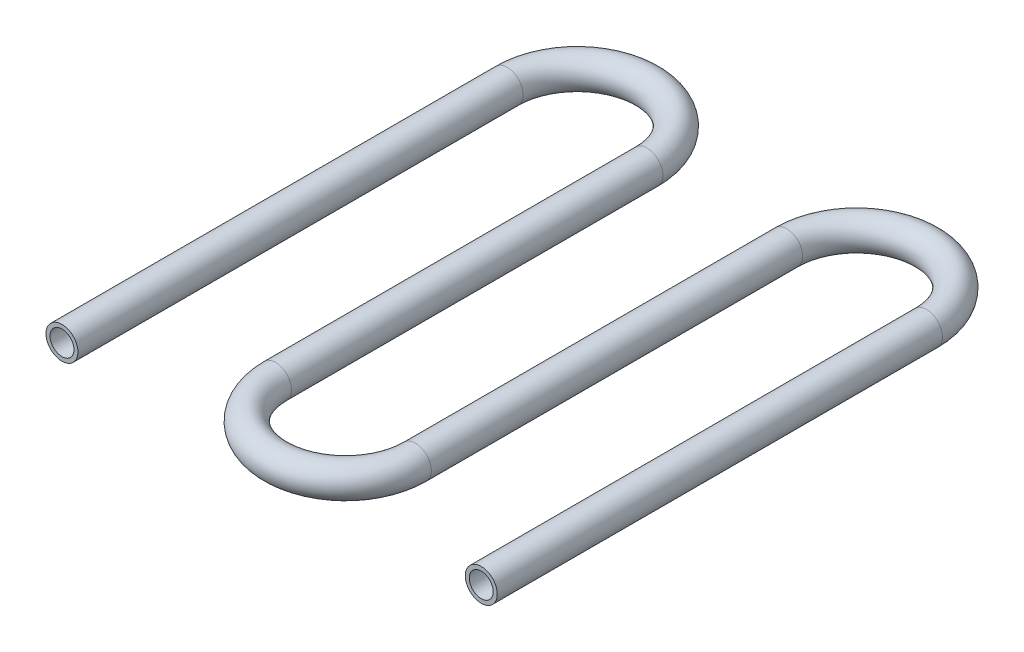
ISO-10303-21;
HEADER;
FILE_DESCRIPTION(('STEP AP214'),'2;1');
FILE_NAME('part.step','',(''),(''),'','','');
FILE_SCHEMA(('AUTOMOTIVE_DESIGN { 1 0 10303 214 1 1 1 1 }'));
ENDSEC;
DATA;
#1=APPLICATION_CONTEXT('core data for automotive mechanical design processes');
#2=APPLICATION_PROTOCOL_DEFINITION('international standard','automotive_design',2000,#1);
#3=PRODUCT_CONTEXT('',#1,'mechanical');
#4=PRODUCT('Part','Part','',(#3));
#5=PRODUCT_RELATED_PRODUCT_CATEGORY('part','',(#4));
#6=PRODUCT_DEFINITION_FORMATION('','',#4);
#7=PRODUCT_DEFINITION_CONTEXT('part definition',#1,'design');
#8=PRODUCT_DEFINITION('design','',#6,#7);
#9=PRODUCT_DEFINITION_SHAPE('','',#8);
#10=(LENGTH_UNIT() NAMED_UNIT(*) SI_UNIT(.MILLI.,.METRE.));
#11=(NAMED_UNIT(*) PLANE_ANGLE_UNIT() SI_UNIT($,.RADIAN.));
#12=(NAMED_UNIT(*) SI_UNIT($,.STERADIAN.) SOLID_ANGLE_UNIT());
#13=UNCERTAINTY_MEASURE_WITH_UNIT(LENGTH_MEASURE(1.E-05),#10,'distance_accuracy_value','');
#14=(GEOMETRIC_REPRESENTATION_CONTEXT(3) GLOBAL_UNCERTAINTY_ASSIGNED_CONTEXT((#13)) GLOBAL_UNIT_ASSIGNED_CONTEXT((#10,
#11,#12)) REPRESENTATION_CONTEXT('',''));
#15=CARTESIAN_POINT('',(0.,0.,0.));
#16=DIRECTION('',(0.,0.,1.));
#17=DIRECTION('',(1.,0.,0.));
#18=AXIS2_PLACEMENT_3D('',#15,#16,#17);
#19=CARTESIAN_POINT('',(-17.5,0.,65.));
#20=DIRECTION('',(0.,0.,-1.));
#21=DIRECTION('',(-1.,0.,0.));
#22=AXIS2_PLACEMENT_3D('',#19,#20,#21);
#23=CYLINDRICAL_SURFACE('',#22,4.);
#24=CARTESIAN_POINT('',(-17.5,0.,-46.5));
#25=DIRECTION('',(0.,0.,1.));
#26=DIRECTION('',(1.,0.,0.));
#27=AXIS2_PLACEMENT_3D('',#24,#25,#26);
#28=CIRCLE('',#27,4.);
#29=CARTESIAN_POINT('',(-21.5,0.,-46.5));
#30=VERTEX_POINT('',#29);
#31=EDGE_CURVE('E65',#30,#30,#28,.T.);
#32=ORIENTED_EDGE('',*,*,#31,.T.);
#33=EDGE_LOOP('',(#32));
#34=FACE_BOUND('',#33,.T.);
#35=CARTESIAN_POINT('',(-17.5,0.,65.));
#36=DIRECTION('',(0.,0.,1.));
#37=DIRECTION('',(1.,0.,0.));
#38=AXIS2_PLACEMENT_3D('',#35,#36,#37);
#39=CIRCLE('',#38,4.);
#40=CARTESIAN_POINT('',(-13.5,0.,65.));
#41=VERTEX_POINT('',#40);
#42=EDGE_CURVE('E61',#41,#41,#39,.T.);
#43=ORIENTED_EDGE('',*,*,#42,.F.);
#44=EDGE_LOOP('',(#43));
#45=FACE_BOUND('',#44,.T.);
#46=ADVANCED_FACE('F37',(#34,#45),#23,.T.);
#47=CARTESIAN_POINT('',(0.,0.,-46.5));
#48=DIRECTION('',(0.,-1.,0.));
#49=DIRECTION('',(0.,0.,-1.));
#50=AXIS2_PLACEMENT_3D('',#47,#48,#49);
#51=TOROIDAL_SURFACE('',#50,17.5,4.);
#52=CARTESIAN_POINT('',(17.5,0.,-46.5));
#53=DIRECTION('',(0.,0.,-1.));
#54=DIRECTION('',(-1.,0.,0.));
#55=AXIS2_PLACEMENT_3D('',#52,#53,#54);
#56=CIRCLE('',#55,4.);
#57=CARTESIAN_POINT('',(21.5,0.,-46.5));
#58=VERTEX_POINT('',#57);
#59=EDGE_CURVE('E69',#58,#58,#56,.T.);
#60=CARTESIAN_POINT('',(0.,0.,-46.5));
#61=DIRECTION('',(0.,-1.,0.));
#62=DIRECTION('',(0.,0.,-1.));
#63=AXIS2_PLACEMENT_3D('',#60,#61,#62);
#64=CIRCLE('',#63,21.5);
#65=EDGE_CURVE('',#30,#58,#64,.T.);
#66=ORIENTED_EDGE('',*,*,#31,.F.);
#67=ORIENTED_EDGE('',*,*,#59,.T.);
#68=ORIENTED_EDGE('',*,*,#65,.T.);
#69=ORIENTED_EDGE('',*,*,#65,.F.);
#70=EDGE_LOOP('',(#66,#68,#67,#69));
#71=FACE_BOUND('',#70,.T.);
#72=ADVANCED_FACE('F122',(#71),#51,.T.);
#73=CARTESIAN_POINT('',(17.5,0.,-46.5));
#74=DIRECTION('',(0.,0.,1.));
#75=DIRECTION('',(1.,0.,0.));
#76=AXIS2_PLACEMENT_3D('',#73,#74,#75);
#77=CYLINDRICAL_SURFACE('',#76,4.);
#78=CARTESIAN_POINT('',(17.5,0.,46.5));
#79=DIRECTION('',(0.,0.,-1.));
#80=DIRECTION('',(-1.,0.,0.));
#81=AXIS2_PLACEMENT_3D('',#78,#79,#80);
#82=CIRCLE('',#81,4.);
#83=CARTESIAN_POINT('',(13.5,0.,46.5));
#84=VERTEX_POINT('',#83);
#85=EDGE_CURVE('E73',#84,#84,#82,.T.);
#86=ORIENTED_EDGE('',*,*,#85,.T.);
#87=EDGE_LOOP('',(#86));
#88=FACE_BOUND('',#87,.T.);
#89=ORIENTED_EDGE('',*,*,#59,.F.);
#90=EDGE_LOOP('',(#89));
#91=FACE_BOUND('',#90,.T.);
#92=ADVANCED_FACE('F126',(#88,#91),#77,.T.);
#93=CARTESIAN_POINT('',(35.,0.,46.5));
#94=DIRECTION('',(0.,1.,0.));
#95=DIRECTION('',(0.,0.,1.));
#96=AXIS2_PLACEMENT_3D('',#93,#94,#95);
#97=TOROIDAL_SURFACE('',#96,17.5,4.);
#98=CARTESIAN_POINT('',(52.5,0.,46.5));
#99=DIRECTION('',(0.,0.,1.));
#100=DIRECTION('',(1.,0.,0.));
#101=AXIS2_PLACEMENT_3D('',#98,#99,#100);
#102=CIRCLE('',#101,4.);
#103=CARTESIAN_POINT('',(56.5,0.,46.5));
#104=VERTEX_POINT('',#103);
#105=EDGE_CURVE('E77',#104,#104,#102,.T.);
#106=CARTESIAN_POINT('',(35.,0.,46.5));
#107=DIRECTION('',(0.,1.,0.));
#108=DIRECTION('',(0.,0.,1.));
#109=AXIS2_PLACEMENT_3D('',#106,#107,#108);
#110=CIRCLE('',#109,21.5);
#111=EDGE_CURVE('',#84,#104,#110,.T.);
#112=ORIENTED_EDGE('',*,*,#85,.F.);
#113=ORIENTED_EDGE('',*,*,#105,.T.);
#114=ORIENTED_EDGE('',*,*,#111,.T.);
#115=ORIENTED_EDGE('',*,*,#111,.F.);
#116=EDGE_LOOP('',(#112,#114,#113,#115));
#117=FACE_BOUND('',#116,.T.);
#118=ADVANCED_FACE('F130',(#117),#97,.T.);
#119=CARTESIAN_POINT('',(52.5,0.,46.5));
#120=DIRECTION('',(0.,0.,-1.));
#121=DIRECTION('',(-1.,0.,0.));
#122=AXIS2_PLACEMENT_3D('',#119,#120,#121);
#123=CYLINDRICAL_SURFACE('',#122,4.);
#124=CARTESIAN_POINT('',(52.5,0.,-46.5));
#125=DIRECTION('',(0.,0.,1.));
#126=DIRECTION('',(1.,0.,0.));
#127=AXIS2_PLACEMENT_3D('',#124,#125,#126);
#128=CIRCLE('',#127,4.);
#129=CARTESIAN_POINT('',(48.5,0.,-46.5));
#130=VERTEX_POINT('',#129);
#131=EDGE_CURVE('E80',#130,#130,#128,.T.);
#132=ORIENTED_EDGE('',*,*,#131,.T.);
#133=EDGE_LOOP('',(#132));
#134=FACE_BOUND('',#133,.T.);
#135=ORIENTED_EDGE('',*,*,#105,.F.);
#136=EDGE_LOOP('',(#135));
#137=FACE_BOUND('',#136,.T.);
#138=ADVANCED_FACE('F102',(#134,#137),#123,.T.);
#139=CARTESIAN_POINT('',(70.,0.,-46.5));
#140=DIRECTION('',(0.,-1.,0.));
#141=DIRECTION('',(0.,0.,-1.));
#142=AXIS2_PLACEMENT_3D('',#139,#140,#141);
#143=TOROIDAL_SURFACE('',#142,17.5,4.);
#144=CARTESIAN_POINT('',(87.5,0.,-46.5));
#145=DIRECTION('',(0.,0.,-1.));
#146=DIRECTION('',(-1.,0.,0.));
#147=AXIS2_PLACEMENT_3D('',#144,#145,#146);
#148=CIRCLE('',#147,4.);
#149=CARTESIAN_POINT('',(91.5,0.,-46.5));
#150=VERTEX_POINT('',#149);
#151=EDGE_CURVE('E41',#150,#150,#148,.T.);
#152=CARTESIAN_POINT('',(70.,0.,-46.5));
#153=DIRECTION('',(0.,-1.,0.));
#154=DIRECTION('',(0.,0.,-1.));
#155=AXIS2_PLACEMENT_3D('',#152,#153,#154);
#156=CIRCLE('',#155,21.5);
#157=EDGE_CURVE('',#130,#150,#156,.T.);
#158=ORIENTED_EDGE('',*,*,#131,.F.);
#159=ORIENTED_EDGE('',*,*,#151,.T.);
#160=ORIENTED_EDGE('',*,*,#157,.T.);
#161=ORIENTED_EDGE('',*,*,#157,.F.);
#162=EDGE_LOOP('',(#158,#160,#159,#161));
#163=FACE_BOUND('',#162,.T.);
#164=ADVANCED_FACE('F89',(#163),#143,.T.);
#165=CARTESIAN_POINT('',(87.5,0.,-46.5));
#166=DIRECTION('',(0.,0.,1.));
#167=DIRECTION('',(1.,0.,0.));
#168=AXIS2_PLACEMENT_3D('',#165,#166,#167);
#169=CYLINDRICAL_SURFACE('',#168,4.);
#170=CARTESIAN_POINT('',(87.5,0.,65.));
#171=DIRECTION('',(0.,0.,-1.));
#172=DIRECTION('',(-1.,0.,0.));
#173=AXIS2_PLACEMENT_3D('',#170,#171,#172);
#174=CIRCLE('',#173,4.);
#175=CARTESIAN_POINT('',(83.5,0.,65.));
#176=VERTEX_POINT('',#175);
#177=EDGE_CURVE('E56',#176,#176,#174,.T.);
#178=ORIENTED_EDGE('',*,*,#177,.T.);
#179=EDGE_LOOP('',(#178));
#180=FACE_BOUND('',#179,.T.);
#181=ORIENTED_EDGE('',*,*,#151,.F.);
#182=EDGE_LOOP('',(#181));
#183=FACE_BOUND('',#182,.T.);
#184=ADVANCED_FACE('F39',(#180,#183),#169,.T.);
#185=CARTESIAN_POINT('',(-17.5,0.,65.));
#186=DIRECTION('',(0.,0.,1.));
#187=DIRECTION('',(1.,0.,0.));
#188=AXIS2_PLACEMENT_3D('',#185,#186,#187);
#189=PLANE('',#188);
#190=CARTESIAN_POINT('',(-17.5,0.,65.));
#191=DIRECTION('',(0.,0.,1.));
#192=DIRECTION('',(1.,0.,0.));
#193=AXIS2_PLACEMENT_3D('',#190,#191,#192);
#194=CIRCLE('',#193,3.);
#195=CARTESIAN_POINT('',(-14.5,0.,65.));
#196=VERTEX_POINT('',#195);
#197=EDGE_CURVE('E60',#196,#196,#194,.F.);
#198=ORIENTED_EDGE('',*,*,#197,.T.);
#199=EDGE_LOOP('',(#198));
#200=FACE_BOUND('',#199,.T.);
#201=ORIENTED_EDGE('',*,*,#42,.T.);
#202=EDGE_LOOP('',(#201));
#203=FACE_BOUND('',#202,.T.);
#204=ADVANCED_FACE('F93',(#200,#203),#189,.T.);
#205=CARTESIAN_POINT('',(87.5,0.,65.));
#206=DIRECTION('',(0.,0.,-1.));
#207=DIRECTION('',(-1.,0.,0.));
#208=AXIS2_PLACEMENT_3D('',#205,#206,#207);
#209=PLANE('',#208);
#210=CARTESIAN_POINT('',(87.5,0.,65.));
#211=DIRECTION('',(0.,0.,-1.));
#212=DIRECTION('',(-1.,0.,0.));
#213=AXIS2_PLACEMENT_3D('',#210,#211,#212);
#214=CIRCLE('',#213,3.);
#215=CARTESIAN_POINT('',(84.5,0.,65.));
#216=VERTEX_POINT('',#215);
#217=EDGE_CURVE('E10',#216,#216,#214,.F.);
#218=ORIENTED_EDGE('',*,*,#217,.F.);
#219=EDGE_LOOP('',(#218));
#220=FACE_BOUND('',#219,.T.);
#221=ORIENTED_EDGE('',*,*,#177,.F.);
#222=EDGE_LOOP('',(#221));
#223=FACE_BOUND('',#222,.T.);
#224=ADVANCED_FACE('F99',(#220,#223),#209,.F.);
#225=CARTESIAN_POINT('',(-17.5,0.,65.));
#226=DIRECTION('',(0.,0.,-1.));
#227=DIRECTION('',(-1.,0.,0.));
#228=AXIS2_PLACEMENT_3D('',#225,#226,#227);
#229=CYLINDRICAL_SURFACE('',#228,3.);
#230=CARTESIAN_POINT('',(-17.5,0.,-46.5));
#231=DIRECTION('',(0.,0.,1.));
#232=DIRECTION('',(1.,0.,0.));
#233=AXIS2_PLACEMENT_3D('',#230,#231,#232);
#234=CIRCLE('',#233,3.);
#235=CARTESIAN_POINT('',(-20.5,0.,-46.5));
#236=VERTEX_POINT('',#235);
#237=EDGE_CURVE('E250',#236,#236,#234,.F.);
#238=ORIENTED_EDGE('',*,*,#237,.T.);
#239=EDGE_LOOP('',(#238));
#240=FACE_BOUND('',#239,.T.);
#241=ORIENTED_EDGE('',*,*,#197,.F.);
#242=EDGE_LOOP('',(#241));
#243=FACE_BOUND('',#242,.T.);
#244=ADVANCED_FACE('F117',(#240,#243),#229,.F.);
#245=CARTESIAN_POINT('',(0.,0.,-46.5));
#246=DIRECTION('',(0.,-1.,0.));
#247=DIRECTION('',(0.,0.,-1.));
#248=AXIS2_PLACEMENT_3D('',#245,#246,#247);
#249=TOROIDAL_SURFACE('',#248,17.5,3.);
#250=CARTESIAN_POINT('',(17.5,0.,-46.5));
#251=DIRECTION('',(0.,0.,-1.));
#252=DIRECTION('',(-1.,0.,0.));
#253=AXIS2_PLACEMENT_3D('',#250,#251,#252);
#254=CIRCLE('',#253,3.);
#255=CARTESIAN_POINT('',(20.5,0.,-46.5));
#256=VERTEX_POINT('',#255);
#257=EDGE_CURVE('E244',#256,#256,#254,.F.);
#258=CARTESIAN_POINT('',(0.,0.,-46.5));
#259=DIRECTION('',(0.,-1.,0.));
#260=DIRECTION('',(0.,0.,-1.));
#261=AXIS2_PLACEMENT_3D('',#258,#259,#260);
#262=CIRCLE('',#261,20.5);
#263=EDGE_CURVE('',#236,#256,#262,.T.);
#264=ORIENTED_EDGE('',*,*,#237,.F.);
#265=ORIENTED_EDGE('',*,*,#257,.T.);
#266=ORIENTED_EDGE('',*,*,#263,.T.);
#267=ORIENTED_EDGE('',*,*,#263,.F.);
#268=EDGE_LOOP('',(#264,#266,#265,#267));
#269=FACE_BOUND('',#268,.T.);
#270=ADVANCED_FACE('F180',(#269),#249,.F.);
#271=CARTESIAN_POINT('',(17.5,0.,-46.5));
#272=DIRECTION('',(0.,0.,1.));
#273=DIRECTION('',(1.,0.,0.));
#274=AXIS2_PLACEMENT_3D('',#271,#272,#273);
#275=CYLINDRICAL_SURFACE('',#274,3.);
#276=CARTESIAN_POINT('',(17.5,0.,46.5));
#277=DIRECTION('',(0.,0.,-1.));
#278=DIRECTION('',(-1.,0.,0.));
#279=AXIS2_PLACEMENT_3D('',#276,#277,#278);
#280=CIRCLE('',#279,3.);
#281=CARTESIAN_POINT('',(14.5,0.,46.5));
#282=VERTEX_POINT('',#281);
#283=EDGE_CURVE('E239',#282,#282,#280,.F.);
#284=ORIENTED_EDGE('',*,*,#283,.T.);
#285=EDGE_LOOP('',(#284));
#286=FACE_BOUND('',#285,.T.);
#287=ORIENTED_EDGE('',*,*,#257,.F.);
#288=EDGE_LOOP('',(#287));
#289=FACE_BOUND('',#288,.T.);
#290=ADVANCED_FACE('F190',(#286,#289),#275,.F.);
#291=CARTESIAN_POINT('',(35.,0.,46.5));
#292=DIRECTION('',(0.,1.,0.));
#293=DIRECTION('',(0.,0.,1.));
#294=AXIS2_PLACEMENT_3D('',#291,#292,#293);
#295=TOROIDAL_SURFACE('',#294,17.5,3.);
#296=CARTESIAN_POINT('',(52.5,0.,46.5));
#297=DIRECTION('',(0.,0.,1.));
#298=DIRECTION('',(1.,0.,0.));
#299=AXIS2_PLACEMENT_3D('',#296,#297,#298);
#300=CIRCLE('',#299,3.);
#301=CARTESIAN_POINT('',(55.5,0.,46.5));
#302=VERTEX_POINT('',#301);
#303=EDGE_CURVE('E237',#302,#302,#300,.F.);
#304=CARTESIAN_POINT('',(35.,0.,46.5));
#305=DIRECTION('',(0.,1.,0.));
#306=DIRECTION('',(0.,0.,1.));
#307=AXIS2_PLACEMENT_3D('',#304,#305,#306);
#308=CIRCLE('',#307,20.5);
#309=EDGE_CURVE('',#282,#302,#308,.T.);
#310=ORIENTED_EDGE('',*,*,#283,.F.);
#311=ORIENTED_EDGE('',*,*,#303,.T.);
#312=ORIENTED_EDGE('',*,*,#309,.T.);
#313=ORIENTED_EDGE('',*,*,#309,.F.);
#314=EDGE_LOOP('',(#310,#312,#311,#313));
#315=FACE_BOUND('',#314,.T.);
#316=ADVANCED_FACE('F200',(#315),#295,.F.);
#317=CARTESIAN_POINT('',(52.5,0.,46.5));
#318=DIRECTION('',(0.,0.,-1.));
#319=DIRECTION('',(-1.,0.,0.));
#320=AXIS2_PLACEMENT_3D('',#317,#318,#319);
#321=CYLINDRICAL_SURFACE('',#320,3.);
#322=CARTESIAN_POINT('',(52.5,0.,-46.5));
#323=DIRECTION('',(0.,0.,1.));
#324=DIRECTION('',(1.,0.,0.));
#325=AXIS2_PLACEMENT_3D('',#322,#323,#324);
#326=CIRCLE('',#325,3.);
#327=CARTESIAN_POINT('',(49.5,0.,-46.5));
#328=VERTEX_POINT('',#327);
#329=EDGE_CURVE('E52',#328,#328,#326,.F.);
#330=ORIENTED_EDGE('',*,*,#329,.T.);
#331=EDGE_LOOP('',(#330));
#332=FACE_BOUND('',#331,.T.);
#333=ORIENTED_EDGE('',*,*,#303,.F.);
#334=EDGE_LOOP('',(#333));
#335=FACE_BOUND('',#334,.T.);
#336=ADVANCED_FACE('F110',(#332,#335),#321,.F.);
#337=CARTESIAN_POINT('',(70.,0.,-46.5));
#338=DIRECTION('',(0.,-1.,0.));
#339=DIRECTION('',(0.,0.,-1.));
#340=AXIS2_PLACEMENT_3D('',#337,#338,#339);
#341=TOROIDAL_SURFACE('',#340,17.5,3.);
#342=CARTESIAN_POINT('',(87.5,0.,-46.5));
#343=DIRECTION('',(0.,0.,-1.));
#344=DIRECTION('',(-1.,0.,0.));
#345=AXIS2_PLACEMENT_3D('',#342,#343,#344);
#346=CIRCLE('',#345,3.);
#347=CARTESIAN_POINT('',(90.5,0.,-46.5));
#348=VERTEX_POINT('',#347);
#349=EDGE_CURVE('E46',#348,#348,#346,.F.);
#350=CARTESIAN_POINT('',(70.,0.,-46.5));
#351=DIRECTION('',(0.,-1.,0.));
#352=DIRECTION('',(0.,0.,-1.));
#353=AXIS2_PLACEMENT_3D('',#350,#351,#352);
#354=CIRCLE('',#353,20.5);
#355=EDGE_CURVE('',#328,#348,#354,.T.);
#356=ORIENTED_EDGE('',*,*,#329,.F.);
#357=ORIENTED_EDGE('',*,*,#349,.T.);
#358=ORIENTED_EDGE('',*,*,#355,.T.);
#359=ORIENTED_EDGE('',*,*,#355,.F.);
#360=EDGE_LOOP('',(#356,#358,#357,#359));
#361=FACE_BOUND('',#360,.T.);
#362=ADVANCED_FACE('F105',(#361),#341,.F.);
#363=CARTESIAN_POINT('',(87.5,0.,-46.5));
#364=DIRECTION('',(0.,0.,1.));
#365=DIRECTION('',(1.,0.,0.));
#366=AXIS2_PLACEMENT_3D('',#363,#364,#365);
#367=CYLINDRICAL_SURFACE('',#366,3.);
#368=ORIENTED_EDGE('',*,*,#217,.T.);
#369=EDGE_LOOP('',(#368));
#370=FACE_BOUND('',#369,.T.);
#371=ORIENTED_EDGE('',*,*,#349,.F.);
#372=EDGE_LOOP('',(#371));
#373=FACE_BOUND('',#372,.T.);
#374=ADVANCED_FACE('F103',(#370,#373),#367,.F.);
#375=CLOSED_SHELL('',(#46,#72,#92,#118,#138,#164,#184,#204,#224,#244,#270,#290,#316,#336,#362,#374));
#376=MANIFOLD_SOLID_BREP('B2',#375);
#377=ADVANCED_BREP_SHAPE_REPRESENTATION('',(#18,#376),#14);
#378=SHAPE_DEFINITION_REPRESENTATION(#9,#377);
ENDSEC;
END-ISO-10303-21;
